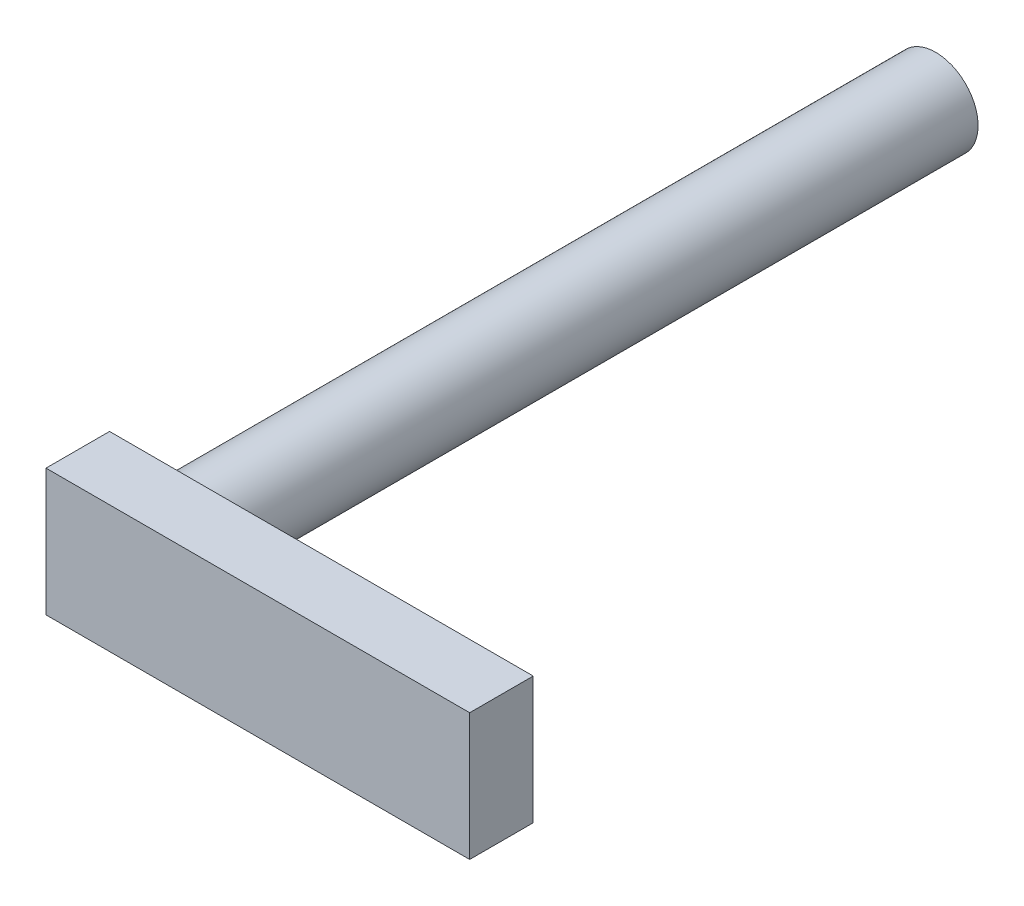
ISO-10303-21;
HEADER;
FILE_DESCRIPTION(('STEP AP214'),'2;1');
FILE_NAME('part.step','',(''),(''),'','','');
FILE_SCHEMA(('AUTOMOTIVE_DESIGN { 1 0 10303 214 1 1 1 1 }'));
ENDSEC;
DATA;
#1=APPLICATION_CONTEXT('core data for automotive mechanical design processes');
#2=APPLICATION_PROTOCOL_DEFINITION('international standard','automotive_design',2000,#1);
#3=PRODUCT_CONTEXT('',#1,'mechanical');
#4=PRODUCT('Part','Part','',(#3));
#5=PRODUCT_RELATED_PRODUCT_CATEGORY('part','',(#4));
#6=PRODUCT_DEFINITION_FORMATION('','',#4);
#7=PRODUCT_DEFINITION_CONTEXT('part definition',#1,'design');
#8=PRODUCT_DEFINITION('design','',#6,#7);
#9=PRODUCT_DEFINITION_SHAPE('','',#8);
#10=(LENGTH_UNIT() NAMED_UNIT(*) SI_UNIT(.MILLI.,.METRE.));
#11=(NAMED_UNIT(*) PLANE_ANGLE_UNIT() SI_UNIT($,.RADIAN.));
#12=(NAMED_UNIT(*) SI_UNIT($,.STERADIAN.) SOLID_ANGLE_UNIT());
#13=UNCERTAINTY_MEASURE_WITH_UNIT(LENGTH_MEASURE(1.E-05),#10,'distance_accuracy_value','');
#14=(GEOMETRIC_REPRESENTATION_CONTEXT(3) GLOBAL_UNCERTAINTY_ASSIGNED_CONTEXT((#13)) GLOBAL_UNIT_ASSIGNED_CONTEXT((#10,
#11,#12)) REPRESENTATION_CONTEXT('',''));
#15=CARTESIAN_POINT('',(0.,0.,0.));
#16=DIRECTION('',(0.,0.,1.));
#17=DIRECTION('',(1.,0.,0.));
#18=AXIS2_PLACEMENT_3D('',#15,#16,#17);
#19=CARTESIAN_POINT('',(-100.,0.,-15.));
#20=DIRECTION('',(0.,0.,-1.));
#21=DIRECTION('',(-1.,0.,0.));
#22=AXIS2_PLACEMENT_3D('',#19,#20,#21);
#23=PLANE('',#22);
#24=CARTESIAN_POINT('',(-85.,15.,-15.));
#25=DIRECTION('',(0.,0.,-1.));
#26=DIRECTION('',(-1.,0.,0.));
#27=AXIS2_PLACEMENT_3D('',#24,#25,#26);
#28=CIRCLE('',#27,12.);
#29=CARTESIAN_POINT('',(-97.,15.,-15.));
#30=VERTEX_POINT('',#29);
#31=EDGE_CURVE('E12',#30,#30,#28,.F.);
#32=ORIENTED_EDGE('',*,*,#31,.T.);
#33=EDGE_LOOP('',(#32));
#34=FACE_BOUND('',#33,.T.);
#35=DIRECTION('',(0.,1.,0.));
#36=VECTOR('',#35,1.);
#37=CARTESIAN_POINT('',(0.,0.,-15.));
#38=LINE('',#37,#36);
#39=CARTESIAN_POINT('',(0.,0.,-15.));
#40=VERTEX_POINT('',#39);
#41=CARTESIAN_POINT('',(0.,30.,-15.));
#42=VERTEX_POINT('',#41);
#43=EDGE_CURVE('E93',#40,#42,#38,.T.);
#44=ORIENTED_EDGE('',*,*,#43,.F.);
#45=DIRECTION('',(1.,0.,0.));
#46=VECTOR('',#45,1.);
#47=CARTESIAN_POINT('',(-100.,0.,-15.));
#48=LINE('',#47,#46);
#49=CARTESIAN_POINT('',(-100.,0.,-15.));
#50=VERTEX_POINT('',#49);
#51=EDGE_CURVE('E89',#50,#40,#48,.T.);
#52=ORIENTED_EDGE('',*,*,#51,.F.);
#53=DIRECTION('',(0.,1.,0.));
#54=VECTOR('',#53,1.);
#55=CARTESIAN_POINT('',(-100.,0.,-15.));
#56=LINE('',#55,#54);
#57=CARTESIAN_POINT('',(-100.,30.,-15.));
#58=VERTEX_POINT('',#57);
#59=EDGE_CURVE('E91',#50,#58,#56,.T.);
#60=ORIENTED_EDGE('',*,*,#59,.T.);
#61=DIRECTION('',(1.,0.,0.));
#62=VECTOR('',#61,1.);
#63=CARTESIAN_POINT('',(-100.,30.,-15.));
#64=LINE('',#63,#62);
#65=EDGE_CURVE('E75',#58,#42,#64,.T.);
#66=ORIENTED_EDGE('',*,*,#65,.T.);
#67=EDGE_LOOP('',(#44,#52,#60,#66));
#68=FACE_BOUND('',#67,.T.);
#69=ADVANCED_FACE('F41',(#34,#68),#23,.T.);
#70=CARTESIAN_POINT('',(-100.,0.,0.));
#71=DIRECTION('',(0.,0.,1.));
#72=DIRECTION('',(1.,0.,0.));
#73=AXIS2_PLACEMENT_3D('',#70,#71,#72);
#74=PLANE('',#73);
#75=DIRECTION('',(0.,-1.,0.));
#76=VECTOR('',#75,1.);
#77=CARTESIAN_POINT('',(0.,0.,0.));
#78=LINE('',#77,#76);
#79=CARTESIAN_POINT('',(0.,30.,0.));
#80=VERTEX_POINT('',#79);
#81=CARTESIAN_POINT('',(0.,0.,0.));
#82=VERTEX_POINT('',#81);
#83=EDGE_CURVE('E109',#80,#82,#78,.T.);
#84=ORIENTED_EDGE('',*,*,#83,.F.);
#85=DIRECTION('',(1.,0.,0.));
#86=VECTOR('',#85,1.);
#87=CARTESIAN_POINT('',(-100.,30.,0.));
#88=LINE('',#87,#86);
#89=CARTESIAN_POINT('',(-100.,30.,0.));
#90=VERTEX_POINT('',#89);
#91=EDGE_CURVE('E58',#90,#80,#88,.T.);
#92=ORIENTED_EDGE('',*,*,#91,.F.);
#93=DIRECTION('',(0.,-1.,0.));
#94=VECTOR('',#93,1.);
#95=CARTESIAN_POINT('',(-100.,0.,0.));
#96=LINE('',#95,#94);
#97=CARTESIAN_POINT('',(-100.,0.,0.));
#98=VERTEX_POINT('',#97);
#99=EDGE_CURVE('E102',#90,#98,#96,.T.);
#100=ORIENTED_EDGE('',*,*,#99,.T.);
#101=DIRECTION('',(1.,0.,0.));
#102=VECTOR('',#101,1.);
#103=CARTESIAN_POINT('',(-100.,0.,0.));
#104=LINE('',#103,#102);
#105=EDGE_CURVE('E86',#98,#82,#104,.T.);
#106=ORIENTED_EDGE('',*,*,#105,.T.);
#107=EDGE_LOOP('',(#84,#92,#100,#106));
#108=FACE_BOUND('',#107,.T.);
#109=ADVANCED_FACE('F141',(#108),#74,.T.);
#110=CARTESIAN_POINT('',(-100.,30.,0.));
#111=DIRECTION('',(0.,1.,0.));
#112=DIRECTION('',(0.,0.,1.));
#113=AXIS2_PLACEMENT_3D('',#110,#111,#112);
#114=PLANE('',#113);
#115=DIRECTION('',(0.,0.,1.));
#116=VECTOR('',#115,1.);
#117=CARTESIAN_POINT('',(0.,30.,0.));
#118=LINE('',#117,#116);
#119=EDGE_CURVE('E104',#42,#80,#118,.T.);
#120=ORIENTED_EDGE('',*,*,#119,.F.);
#121=ORIENTED_EDGE('',*,*,#65,.F.);
#122=DIRECTION('',(0.,0.,1.));
#123=VECTOR('',#122,1.);
#124=CARTESIAN_POINT('',(-100.,30.,0.));
#125=LINE('',#124,#123);
#126=EDGE_CURVE('E99',#58,#90,#125,.T.);
#127=ORIENTED_EDGE('',*,*,#126,.T.);
#128=ORIENTED_EDGE('',*,*,#91,.T.);
#129=EDGE_LOOP('',(#120,#121,#127,#128));
#130=FACE_BOUND('',#129,.T.);
#131=ADVANCED_FACE('F147',(#130),#114,.T.);
#132=CARTESIAN_POINT('',(-100.,0.,0.));
#133=DIRECTION('',(0.,-1.,0.));
#134=DIRECTION('',(0.,0.,-1.));
#135=AXIS2_PLACEMENT_3D('',#132,#133,#134);
#136=PLANE('',#135);
#137=DIRECTION('',(0.,0.,-1.));
#138=VECTOR('',#137,1.);
#139=CARTESIAN_POINT('',(0.,0.,0.));
#140=LINE('',#139,#138);
#141=EDGE_CURVE('E112',#82,#40,#140,.T.);
#142=ORIENTED_EDGE('',*,*,#141,.F.);
#143=ORIENTED_EDGE('',*,*,#105,.F.);
#144=DIRECTION('',(0.,0.,-1.));
#145=VECTOR('',#144,1.);
#146=CARTESIAN_POINT('',(-100.,0.,0.));
#147=LINE('',#146,#145);
#148=EDGE_CURVE('E98',#98,#50,#147,.T.);
#149=ORIENTED_EDGE('',*,*,#148,.T.);
#150=ORIENTED_EDGE('',*,*,#51,.T.);
#151=EDGE_LOOP('',(#142,#143,#149,#150));
#152=FACE_BOUND('',#151,.T.);
#153=ADVANCED_FACE('F101',(#152),#136,.T.);
#154=CARTESIAN_POINT('',(-100.,30.,0.));
#155=DIRECTION('',(-1.,0.,0.));
#156=DIRECTION('',(0.,0.,1.));
#157=AXIS2_PLACEMENT_3D('',#154,#155,#156);
#158=PLANE('',#157);
#159=ORIENTED_EDGE('',*,*,#99,.F.);
#160=ORIENTED_EDGE('',*,*,#126,.F.);
#161=ORIENTED_EDGE('',*,*,#59,.F.);
#162=ORIENTED_EDGE('',*,*,#148,.F.);
#163=EDGE_LOOP('',(#159,#160,#161,#162));
#164=FACE_BOUND('',#163,.T.);
#165=ADVANCED_FACE('F97',(#164),#158,.T.);
#166=CARTESIAN_POINT('',(0.,30.,0.));
#167=DIRECTION('',(-1.,0.,0.));
#168=DIRECTION('',(0.,0.,1.));
#169=AXIS2_PLACEMENT_3D('',#166,#167,#168);
#170=PLANE('',#169);
#171=ORIENTED_EDGE('',*,*,#83,.T.);
#172=ORIENTED_EDGE('',*,*,#141,.T.);
#173=ORIENTED_EDGE('',*,*,#43,.T.);
#174=ORIENTED_EDGE('',*,*,#119,.T.);
#175=EDGE_LOOP('',(#171,#172,#173,#174));
#176=FACE_BOUND('',#175,.T.);
#177=ADVANCED_FACE('F156',(#176),#170,.F.);
#178=CARTESIAN_POINT('',(-85.,15.,-195.));
#179=DIRECTION('',(0.,0.,1.));
#180=DIRECTION('',(1.,0.,0.));
#181=AXIS2_PLACEMENT_3D('',#178,#179,#180);
#182=CYLINDRICAL_SURFACE('',#181,9.99999999999999);
#183=CARTESIAN_POINT('',(-85.,15.,-17.));
#184=DIRECTION('',(0.,0.,-1.));
#185=DIRECTION('',(-1.,0.,0.));
#186=AXIS2_PLACEMENT_3D('',#183,#184,#185);
#187=CIRCLE('',#186,9.99999999999999);
#188=CARTESIAN_POINT('',(-95.,15.,-17.));
#189=VERTEX_POINT('',#188);
#190=EDGE_CURVE('E50',#189,#189,#187,.T.);
#191=ORIENTED_EDGE('',*,*,#190,.T.);
#192=EDGE_LOOP('',(#191));
#193=FACE_BOUND('',#192,.T.);
#194=CARTESIAN_POINT('',(-85.,15.,-195.));
#195=DIRECTION('',(0.,0.,-1.));
#196=DIRECTION('',(-1.,0.,0.));
#197=AXIS2_PLACEMENT_3D('',#194,#195,#196);
#198=CIRCLE('',#197,9.99999999999999);
#199=CARTESIAN_POINT('',(-95.,15.,-195.));
#200=VERTEX_POINT('',#199);
#201=EDGE_CURVE('E113',#200,#200,#198,.T.);
#202=ORIENTED_EDGE('',*,*,#201,.F.);
#203=EDGE_LOOP('',(#202));
#204=FACE_BOUND('',#203,.T.);
#205=ADVANCED_FACE('F128',(#193,#204),#182,.T.);
#206=CARTESIAN_POINT('',(-85.,15.,-195.));
#207=DIRECTION('',(0.,0.,-1.));
#208=DIRECTION('',(-1.,0.,0.));
#209=AXIS2_PLACEMENT_3D('',#206,#207,#208);
#210=PLANE('',#209);
#211=ORIENTED_EDGE('',*,*,#201,.T.);
#212=EDGE_LOOP('',(#211));
#213=FACE_BOUND('',#212,.T.);
#214=ADVANCED_FACE('F132',(#213),#210,.T.);
#215=CARTESIAN_POINT('',(-85.,15.,-17.));
#216=DIRECTION('',(0.,0.,-1.));
#217=DIRECTION('',(-1.,0.,0.));
#218=AXIS2_PLACEMENT_3D('',#215,#216,#217);
#219=TOROIDAL_SURFACE('',#218,12.,2.);
#220=ORIENTED_EDGE('',*,*,#31,.F.);
#221=EDGE_LOOP('',(#220));
#222=FACE_BOUND('',#221,.T.);
#223=ORIENTED_EDGE('',*,*,#190,.F.);
#224=EDGE_LOOP('',(#223));
#225=FACE_BOUND('',#224,.T.);
#226=ADVANCED_FACE('F43',(#222,#225),#219,.F.);
#227=CLOSED_SHELL('',(#69,#109,#131,#153,#165,#177,#205,#214,#226));
#228=MANIFOLD_SOLID_BREP('B2',#227);
#229=ADVANCED_BREP_SHAPE_REPRESENTATION('',(#18,#228),#14);
#230=SHAPE_DEFINITION_REPRESENTATION(#9,#229);
ENDSEC;
END-ISO-10303-21;
